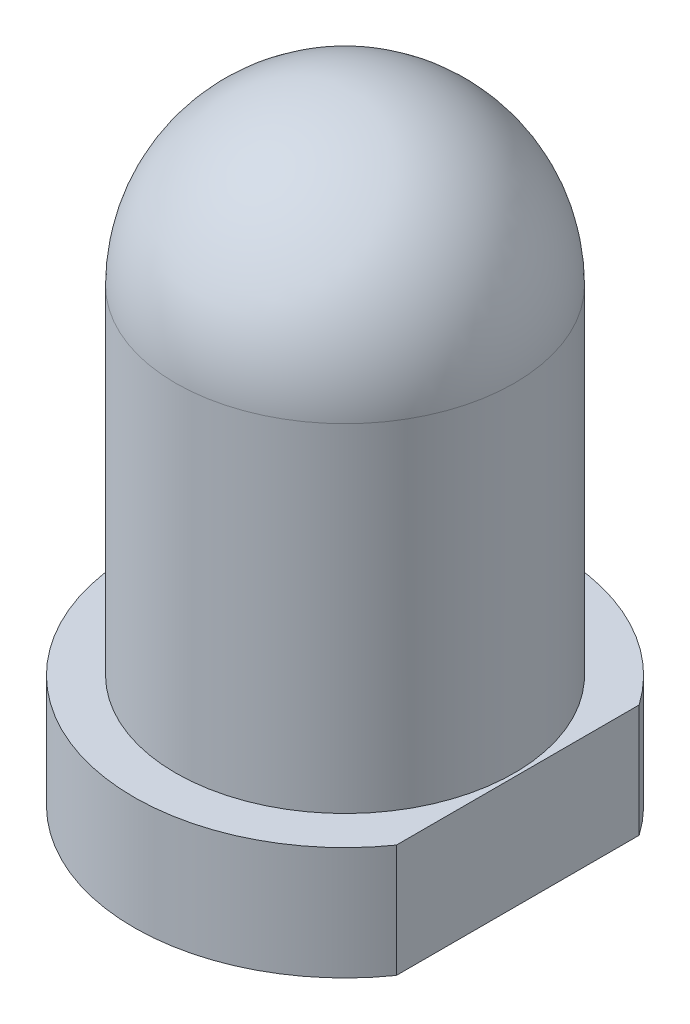
ISO-10303-21;
HEADER;
FILE_DESCRIPTION(('STEP AP214'),'2;1');
FILE_NAME('part.step','',(''),(''),'','','');
FILE_SCHEMA(('AUTOMOTIVE_DESIGN { 1 0 10303 214 1 1 1 1 }'));
ENDSEC;
DATA;
#1=APPLICATION_CONTEXT('core data for automotive mechanical design processes');
#2=APPLICATION_PROTOCOL_DEFINITION('international standard','automotive_design',2000,#1);
#3=PRODUCT_CONTEXT('',#1,'mechanical');
#4=PRODUCT('Part','Part','',(#3));
#5=PRODUCT_RELATED_PRODUCT_CATEGORY('part','',(#4));
#6=PRODUCT_DEFINITION_FORMATION('','',#4);
#7=PRODUCT_DEFINITION_CONTEXT('part definition',#1,'design');
#8=PRODUCT_DEFINITION('design','',#6,#7);
#9=PRODUCT_DEFINITION_SHAPE('','',#8);
#10=(LENGTH_UNIT() NAMED_UNIT(*) SI_UNIT(.MILLI.,.METRE.));
#11=(NAMED_UNIT(*) PLANE_ANGLE_UNIT() SI_UNIT($,.RADIAN.));
#12=(NAMED_UNIT(*) SI_UNIT($,.STERADIAN.) SOLID_ANGLE_UNIT());
#13=UNCERTAINTY_MEASURE_WITH_UNIT(LENGTH_MEASURE(1.E-05),#10,'distance_accuracy_value','');
#14=(GEOMETRIC_REPRESENTATION_CONTEXT(3) GLOBAL_UNCERTAINTY_ASSIGNED_CONTEXT((#13)) GLOBAL_UNIT_ASSIGNED_CONTEXT((#10,
#11,#12)) REPRESENTATION_CONTEXT('',''));
#15=CARTESIAN_POINT('',(0.,0.,0.));
#16=DIRECTION('',(0.,0.,1.));
#17=DIRECTION('',(1.,0.,0.));
#18=AXIS2_PLACEMENT_3D('',#15,#16,#17);
#19=CARTESIAN_POINT('',(0.,1.,0.));
#20=DIRECTION('',(0.,-1.,0.));
#21=DIRECTION('',(0.,0.,-1.));
#22=AXIS2_PLACEMENT_3D('',#19,#20,#21);
#23=CYLINDRICAL_SURFACE('',#22,1.87);
#24=CARTESIAN_POINT('',(0.,1.,0.));
#25=DIRECTION('',(0.,1.,0.));
#26=DIRECTION('',(0.,0.,1.));
#27=AXIS2_PLACEMENT_3D('',#24,#25,#26);
#28=CIRCLE('',#27,1.87);
#29=CARTESIAN_POINT('',(1.53001853746587,1.,-1.07514802469744));
#30=VERTEX_POINT('',#29);
#31=CARTESIAN_POINT('',(1.53001853746587,1.,1.07514802469744));
#32=VERTEX_POINT('',#31);
#33=EDGE_CURVE('E68',#30,#32,#28,.T.);
#34=ORIENTED_EDGE('',*,*,#33,.F.);
#35=DIRECTION('',(0.,-1.,0.));
#36=VECTOR('',#35,1.);
#37=CARTESIAN_POINT('',(1.53001853746587,1.,-1.07514802469744));
#38=LINE('',#37,#36);
#39=CARTESIAN_POINT('',(1.53001853746587,0.,-1.07514802469744));
#40=VERTEX_POINT('',#39);
#41=EDGE_CURVE('E54',#30,#40,#38,.T.);
#42=ORIENTED_EDGE('',*,*,#41,.T.);
#43=CARTESIAN_POINT('',(0.,0.,0.));
#44=DIRECTION('',(0.,1.,0.));
#45=DIRECTION('',(0.,0.,1.));
#46=AXIS2_PLACEMENT_3D('',#43,#44,#45);
#47=CIRCLE('',#46,1.87);
#48=CARTESIAN_POINT('',(1.53001853746587,0.,1.07514802469744));
#49=VERTEX_POINT('',#48);
#50=EDGE_CURVE('E70',#40,#49,#47,.T.);
#51=ORIENTED_EDGE('',*,*,#50,.T.);
#52=DIRECTION('',(0.,-1.,0.));
#53=VECTOR('',#52,1.);
#54=CARTESIAN_POINT('',(1.53001853746587,1.,1.07514802469744));
#55=LINE('',#54,#53);
#56=EDGE_CURVE('E47',#49,#32,#55,.F.);
#57=ORIENTED_EDGE('',*,*,#56,.T.);
#58=EDGE_LOOP('',(#34,#42,#51,#57));
#59=FACE_BOUND('',#58,.T.);
#60=ADVANCED_FACE('F33',(#59),#23,.T.);
#61=CARTESIAN_POINT('',(0.,1.,0.));
#62=DIRECTION('',(0.,1.,0.));
#63=DIRECTION('',(0.,0.,1.));
#64=AXIS2_PLACEMENT_3D('',#61,#62,#63);
#65=PLANE('',#64);
#66=DIRECTION('',(0.,0.,1.));
#67=VECTOR('',#66,1.);
#68=CARTESIAN_POINT('',(1.53001853746587,1.,-1.5071748577209));
#69=LINE('',#68,#67);
#70=EDGE_CURVE('E57',#30,#32,#69,.T.);
#71=ORIENTED_EDGE('',*,*,#70,.F.);
#72=ORIENTED_EDGE('',*,*,#33,.T.);
#73=EDGE_LOOP('',(#71,#72));
#74=FACE_BOUND('',#73,.T.);
#75=CARTESIAN_POINT('',(0.,1.,0.));
#76=DIRECTION('',(0.,1.,0.));
#77=DIRECTION('',(0.,0.,1.));
#78=AXIS2_PLACEMENT_3D('',#75,#76,#77);
#79=CIRCLE('',#78,1.5);
#80=CARTESIAN_POINT('',(0.,1.,1.5));
#81=VERTEX_POINT('',#80);
#82=EDGE_CURVE('E40',#81,#81,#79,.T.);
#83=ORIENTED_EDGE('',*,*,#82,.F.);
#84=EDGE_LOOP('',(#83));
#85=FACE_BOUND('',#84,.T.);
#86=ADVANCED_FACE('F66',(#74,#85),#65,.T.);
#87=CARTESIAN_POINT('',(0.,0.,0.));
#88=DIRECTION('',(0.,1.,0.));
#89=DIRECTION('',(0.,0.,1.));
#90=AXIS2_PLACEMENT_3D('',#87,#88,#89);
#91=PLANE('',#90);
#92=ORIENTED_EDGE('',*,*,#50,.F.);
#93=DIRECTION('',(0.,0.,1.));
#94=VECTOR('',#93,1.);
#95=CARTESIAN_POINT('',(1.53001853746587,0.,0.));
#96=LINE('',#95,#94);
#97=EDGE_CURVE('E11',#40,#49,#96,.T.);
#98=ORIENTED_EDGE('',*,*,#97,.T.);
#99=EDGE_LOOP('',(#92,#98));
#100=FACE_BOUND('',#99,.T.);
#101=ADVANCED_FACE('F83',(#100),#91,.F.);
#102=CARTESIAN_POINT('',(0.,5.49,0.));
#103=DIRECTION('',(0.,1.,0.));
#104=DIRECTION('',(-1.,0.,0.));
#105=AXIS2_PLACEMENT_3D('',#102,#103,#104);
#106=CYLINDRICAL_SURFACE('',#105,1.5);
#107=ORIENTED_EDGE('',*,*,#82,.T.);
#108=EDGE_LOOP('',(#107));
#109=FACE_BOUND('',#108,.T.);
#110=CARTESIAN_POINT('',(0.,3.99,0.));
#111=DIRECTION('',(0.,1.,0.));
#112=DIRECTION('',(-1.,0.,0.));
#113=AXIS2_PLACEMENT_3D('',#110,#111,#112);
#114=CIRCLE('',#113,1.5);
#115=CARTESIAN_POINT('',(-1.5,3.99,0.));
#116=VERTEX_POINT('',#115);
#117=EDGE_CURVE('E62',#116,#116,#114,.T.);
#118=ORIENTED_EDGE('',*,*,#117,.F.);
#119=EDGE_LOOP('',(#118));
#120=FACE_BOUND('',#119,.T.);
#121=ADVANCED_FACE('F81',(#109,#120),#106,.T.);
#122=CARTESIAN_POINT('',(0.,3.99,0.));
#123=DIRECTION('',(0.,1.,0.));
#124=DIRECTION('',(1.,0.,0.));
#125=AXIS2_PLACEMENT_3D('',#122,#123,#124);
#126=SPHERICAL_SURFACE('',#125,1.5);
#127=ORIENTED_EDGE('',*,*,#117,.T.);
#128=EDGE_LOOP('',(#127));
#129=FACE_BOUND('',#128,.T.);
#130=ADVANCED_FACE('F79',(#129),#126,.T.);
#131=CARTESIAN_POINT('',(1.53001853746587,0.,-1.5071748577209));
#132=DIRECTION('',(-1.,0.,0.));
#133=DIRECTION('',(0.,0.,1.));
#134=AXIS2_PLACEMENT_3D('',#131,#132,#133);
#135=PLANE('',#134);
#136=ORIENTED_EDGE('',*,*,#70,.T.);
#137=ORIENTED_EDGE('',*,*,#56,.F.);
#138=ORIENTED_EDGE('',*,*,#97,.F.);
#139=ORIENTED_EDGE('',*,*,#41,.F.);
#140=EDGE_LOOP('',(#136,#137,#138,#139));
#141=FACE_BOUND('',#140,.T.);
#142=ADVANCED_FACE('F56',(#141),#135,.F.);
#143=CLOSED_SHELL('',(#60,#86,#101,#121,#130,#142));
#144=MANIFOLD_SOLID_BREP('B2',#143);
#145=ADVANCED_BREP_SHAPE_REPRESENTATION('',(#18,#144),#14);
#146=SHAPE_DEFINITION_REPRESENTATION(#9,#145);
ENDSEC;
END-ISO-10303-21;
